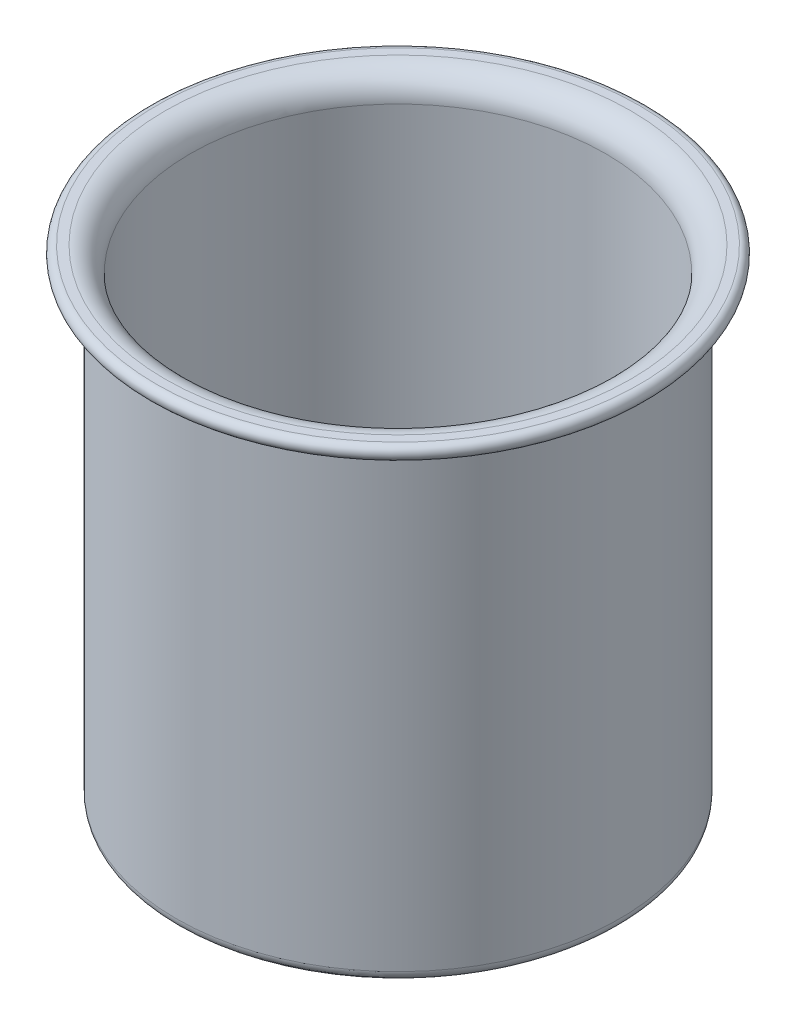
ISO-10303-21;
HEADER;
FILE_DESCRIPTION(('STEP AP214'),'2;1');
FILE_NAME('part.step','',(''),(''),'','','');
FILE_SCHEMA(('AUTOMOTIVE_DESIGN { 1 0 10303 214 1 1 1 1 }'));
ENDSEC;
DATA;
#1=APPLICATION_CONTEXT('core data for automotive mechanical design processes');
#2=APPLICATION_PROTOCOL_DEFINITION('international standard','automotive_design',2000,#1);
#3=PRODUCT_CONTEXT('',#1,'mechanical');
#4=PRODUCT('Part','Part','',(#3));
#5=PRODUCT_RELATED_PRODUCT_CATEGORY('part','',(#4));
#6=PRODUCT_DEFINITION_FORMATION('','',#4);
#7=PRODUCT_DEFINITION_CONTEXT('part definition',#1,'design');
#8=PRODUCT_DEFINITION('design','',#6,#7);
#9=PRODUCT_DEFINITION_SHAPE('','',#8);
#10=(LENGTH_UNIT() NAMED_UNIT(*) SI_UNIT(.MILLI.,.METRE.));
#11=(NAMED_UNIT(*) PLANE_ANGLE_UNIT() SI_UNIT($,.RADIAN.));
#12=(NAMED_UNIT(*) SI_UNIT($,.STERADIAN.) SOLID_ANGLE_UNIT());
#13=UNCERTAINTY_MEASURE_WITH_UNIT(LENGTH_MEASURE(1.E-05),#10,'distance_accuracy_value','');
#14=(GEOMETRIC_REPRESENTATION_CONTEXT(3) GLOBAL_UNCERTAINTY_ASSIGNED_CONTEXT((#13)) GLOBAL_UNIT_ASSIGNED_CONTEXT((#10,
#11,#12)) REPRESENTATION_CONTEXT('',''));
#15=CARTESIAN_POINT('',(0.,0.,0.));
#16=DIRECTION('',(0.,0.,1.));
#17=DIRECTION('',(1.,0.,0.));
#18=AXIS2_PLACEMENT_3D('',#15,#16,#17);
#19=CARTESIAN_POINT('',(0.,0.,0.));
#20=DIRECTION('',(0.,1.,0.));
#21=DIRECTION('',(0.,0.,1.));
#22=AXIS2_PLACEMENT_3D('',#19,#20,#21);
#23=PLANE('',#22);
#24=CARTESIAN_POINT('',(0.,0.,0.));
#25=DIRECTION('',(0.,-1.,0.));
#26=DIRECTION('',(0.,0.,-1.));
#27=AXIS2_PLACEMENT_3D('',#24,#25,#26);
#28=CIRCLE('',#27,59.5);
#29=CARTESIAN_POINT('',(0.,0.,-59.5));
#30=VERTEX_POINT('',#29);
#31=EDGE_CURVE('E10',#30,#30,#28,.T.);
#32=ORIENTED_EDGE('',*,*,#31,.T.);
#33=EDGE_LOOP('',(#32));
#34=FACE_BOUND('',#33,.T.);
#35=ADVANCED_FACE('F41',(#34),#23,.F.);
#36=CARTESIAN_POINT('',(0.,2.99999999999999,0.));
#37=DIRECTION('',(0.,-1.,0.));
#38=DIRECTION('',(0.,0.,-1.));
#39=AXIS2_PLACEMENT_3D('',#36,#37,#38);
#40=TOROIDAL_SURFACE('',#39,59.5,3.);
#41=ORIENTED_EDGE('',*,*,#31,.F.);
#42=EDGE_LOOP('',(#41));
#43=FACE_BOUND('',#42,.T.);
#44=CARTESIAN_POINT('',(0.,2.99999999999999,0.));
#45=DIRECTION('',(0.,-1.,0.));
#46=DIRECTION('',(0.,0.,-1.));
#47=AXIS2_PLACEMENT_3D('',#44,#45,#46);
#48=CIRCLE('',#47,62.5);
#49=CARTESIAN_POINT('',(0.,2.99999999999999,-62.5));
#50=VERTEX_POINT('',#49);
#51=EDGE_CURVE('E48',#50,#50,#48,.T.);
#52=ORIENTED_EDGE('',*,*,#51,.T.);
#53=EDGE_LOOP('',(#52));
#54=FACE_BOUND('',#53,.T.);
#55=ADVANCED_FACE('F97',(#43,#54),#40,.T.);
#56=CARTESIAN_POINT('',(0.,0.,0.));
#57=DIRECTION('',(0.,-1.,0.));
#58=DIRECTION('',(0.,0.,-1.));
#59=AXIS2_PLACEMENT_3D('',#56,#57,#58);
#60=CYLINDRICAL_SURFACE('',#59,62.5);
#61=ORIENTED_EDGE('',*,*,#51,.F.);
#62=EDGE_LOOP('',(#61));
#63=FACE_BOUND('',#62,.T.);
#64=CARTESIAN_POINT('',(0.,129.,0.));
#65=DIRECTION('',(0.,-1.,0.));
#66=DIRECTION('',(0.,0.,-1.));
#67=AXIS2_PLACEMENT_3D('',#64,#65,#66);
#68=CIRCLE('',#67,62.5);
#69=CARTESIAN_POINT('',(0.,129.,-62.5));
#70=VERTEX_POINT('',#69);
#71=EDGE_CURVE('E53',#70,#70,#68,.T.);
#72=ORIENTED_EDGE('',*,*,#71,.T.);
#73=EDGE_LOOP('',(#72));
#74=FACE_BOUND('',#73,.T.);
#75=ADVANCED_FACE('F101',(#63,#74),#60,.T.);
#76=CARTESIAN_POINT('',(0.,129.,0.));
#77=DIRECTION('',(0.,-1.,0.));
#78=DIRECTION('',(0.,0.,-1.));
#79=AXIS2_PLACEMENT_3D('',#76,#77,#78);
#80=TOROIDAL_SURFACE('',#79,65.5,3.00000000000002);
#81=ORIENTED_EDGE('',*,*,#71,.F.);
#82=EDGE_LOOP('',(#81));
#83=FACE_BOUND('',#82,.T.);
#84=CARTESIAN_POINT('',(0.,132.,0.));
#85=DIRECTION('',(0.,-1.,0.));
#86=DIRECTION('',(0.,0.,-1.));
#87=AXIS2_PLACEMENT_3D('',#84,#85,#86);
#88=CIRCLE('',#87,65.5);
#89=CARTESIAN_POINT('',(0.,132.,-65.5));
#90=VERTEX_POINT('',#89);
#91=EDGE_CURVE('E58',#90,#90,#88,.T.);
#92=ORIENTED_EDGE('',*,*,#91,.T.);
#93=EDGE_LOOP('',(#92));
#94=FACE_BOUND('',#93,.T.);
#95=ADVANCED_FACE('F106',(#83,#94),#80,.F.);
#96=CARTESIAN_POINT('',(-65.5,132.,0.));
#97=DIRECTION('',(0.,1.,0.));
#98=DIRECTION('',(0.,0.,1.));
#99=AXIS2_PLACEMENT_3D('',#96,#97,#98);
#100=PLANE('',#99);
#101=ORIENTED_EDGE('',*,*,#91,.F.);
#102=EDGE_LOOP('',(#101));
#103=FACE_BOUND('',#102,.T.);
#104=CARTESIAN_POINT('',(0.,132.,0.));
#105=DIRECTION('',(0.,-1.,0.));
#106=DIRECTION('',(0.,0.,-1.));
#107=AXIS2_PLACEMENT_3D('',#104,#105,#106);
#108=CIRCLE('',#107,67.9835993320299);
#109=CARTESIAN_POINT('',(0.,132.,-67.9835993320299));
#110=VERTEX_POINT('',#109);
#111=EDGE_CURVE('E64',#110,#110,#108,.T.);
#112=ORIENTED_EDGE('',*,*,#111,.T.);
#113=EDGE_LOOP('',(#112));
#114=FACE_BOUND('',#113,.T.);
#115=ADVANCED_FACE('F112',(#103,#114),#100,.F.);
#116=CARTESIAN_POINT('',(0.,134.,0.));
#117=DIRECTION('',(0.,-1.,0.));
#118=DIRECTION('',(0.,0.,-1.));
#119=AXIS2_PLACEMENT_3D('',#116,#117,#118);
#120=TOROIDAL_SURFACE('',#119,67.9835993320299,1.99999999999999);
#121=ORIENTED_EDGE('',*,*,#111,.F.);
#122=EDGE_LOOP('',(#121));
#123=FACE_BOUND('',#122,.T.);
#124=CARTESIAN_POINT('',(0.,136.,0.));
#125=DIRECTION('',(0.,-1.,0.));
#126=DIRECTION('',(0.,0.,-1.));
#127=AXIS2_PLACEMENT_3D('',#124,#125,#126);
#128=CIRCLE('',#127,67.9835993320299);
#129=CARTESIAN_POINT('',(0.,136.,-67.9835993320299));
#130=VERTEX_POINT('',#129);
#131=EDGE_CURVE('E68',#130,#130,#128,.T.);
#132=ORIENTED_EDGE('',*,*,#131,.T.);
#133=EDGE_LOOP('',(#132));
#134=FACE_BOUND('',#133,.T.);
#135=ADVANCED_FACE('F116',(#123,#134),#120,.T.);
#136=CARTESIAN_POINT('',(-65.5,136.,0.));
#137=DIRECTION('',(0.,-1.,0.));
#138=DIRECTION('',(0.,0.,-1.));
#139=AXIS2_PLACEMENT_3D('',#136,#137,#138);
#140=PLANE('',#139);
#141=ORIENTED_EDGE('',*,*,#131,.F.);
#142=EDGE_LOOP('',(#141));
#143=FACE_BOUND('',#142,.T.);
#144=CARTESIAN_POINT('',(0.,136.,0.));
#145=DIRECTION('',(0.,-1.,0.));
#146=DIRECTION('',(0.,0.,-1.));
#147=AXIS2_PLACEMENT_3D('',#144,#145,#146);
#148=CIRCLE('',#147,65.5);
#149=CARTESIAN_POINT('',(0.,136.,-65.5));
#150=VERTEX_POINT('',#149);
#151=EDGE_CURVE('E72',#150,#150,#148,.T.);
#152=ORIENTED_EDGE('',*,*,#151,.T.);
#153=EDGE_LOOP('',(#152));
#154=FACE_BOUND('',#153,.T.);
#155=ADVANCED_FACE('F120',(#143,#154),#140,.F.);
#156=CARTESIAN_POINT('',(0.,129.,0.));
#157=DIRECTION('',(0.,-1.,0.));
#158=DIRECTION('',(0.,0.,-1.));
#159=AXIS2_PLACEMENT_3D('',#156,#157,#158);
#160=TOROIDAL_SURFACE('',#159,65.5,7.00000000000001);
#161=ORIENTED_EDGE('',*,*,#151,.F.);
#162=EDGE_LOOP('',(#161));
#163=FACE_BOUND('',#162,.T.);
#164=CARTESIAN_POINT('',(0.,129.,0.));
#165=DIRECTION('',(0.,-1.,0.));
#166=DIRECTION('',(0.,0.,-1.));
#167=AXIS2_PLACEMENT_3D('',#164,#165,#166);
#168=CIRCLE('',#167,58.5);
#169=CARTESIAN_POINT('',(0.,129.,-58.5));
#170=VERTEX_POINT('',#169);
#171=EDGE_CURVE('E76',#170,#170,#168,.T.);
#172=ORIENTED_EDGE('',*,*,#171,.T.);
#173=EDGE_LOOP('',(#172));
#174=FACE_BOUND('',#173,.T.);
#175=ADVANCED_FACE('F93',(#163,#174),#160,.T.);
#176=CARTESIAN_POINT('',(0.,0.,0.));
#177=DIRECTION('',(0.,-1.,0.));
#178=DIRECTION('',(0.,0.,-1.));
#179=AXIS2_PLACEMENT_3D('',#176,#177,#178);
#180=CYLINDRICAL_SURFACE('',#179,58.5);
#181=ORIENTED_EDGE('',*,*,#171,.F.);
#182=EDGE_LOOP('',(#181));
#183=FACE_BOUND('',#182,.T.);
#184=CARTESIAN_POINT('',(0.,4.,0.));
#185=DIRECTION('',(0.,-1.,0.));
#186=DIRECTION('',(0.,0.,-1.));
#187=AXIS2_PLACEMENT_3D('',#184,#185,#186);
#188=CIRCLE('',#187,58.5);
#189=CARTESIAN_POINT('',(0.,4.,-58.5));
#190=VERTEX_POINT('',#189);
#191=EDGE_CURVE('E80',#190,#190,#188,.T.);
#192=ORIENTED_EDGE('',*,*,#191,.T.);
#193=EDGE_LOOP('',(#192));
#194=FACE_BOUND('',#193,.T.);
#195=ADVANCED_FACE('F85',(#183,#194),#180,.F.);
#196=CARTESIAN_POINT('',(0.,4.,0.));
#197=DIRECTION('',(0.,-1.,0.));
#198=DIRECTION('',(0.,0.,-1.));
#199=AXIS2_PLACEMENT_3D('',#196,#197,#198);
#200=PLANE('',#199);
#201=ORIENTED_EDGE('',*,*,#191,.F.);
#202=EDGE_LOOP('',(#201));
#203=FACE_BOUND('',#202,.T.);
#204=ADVANCED_FACE('F87',(#203),#200,.F.);
#205=CLOSED_SHELL('',(#35,#55,#75,#95,#115,#135,#155,#175,#195,#204));
#206=MANIFOLD_SOLID_BREP('B2',#205);
#207=ADVANCED_BREP_SHAPE_REPRESENTATION('',(#18,#206),#14);
#208=SHAPE_DEFINITION_REPRESENTATION(#9,#207);
ENDSEC;
END-ISO-10303-21;
